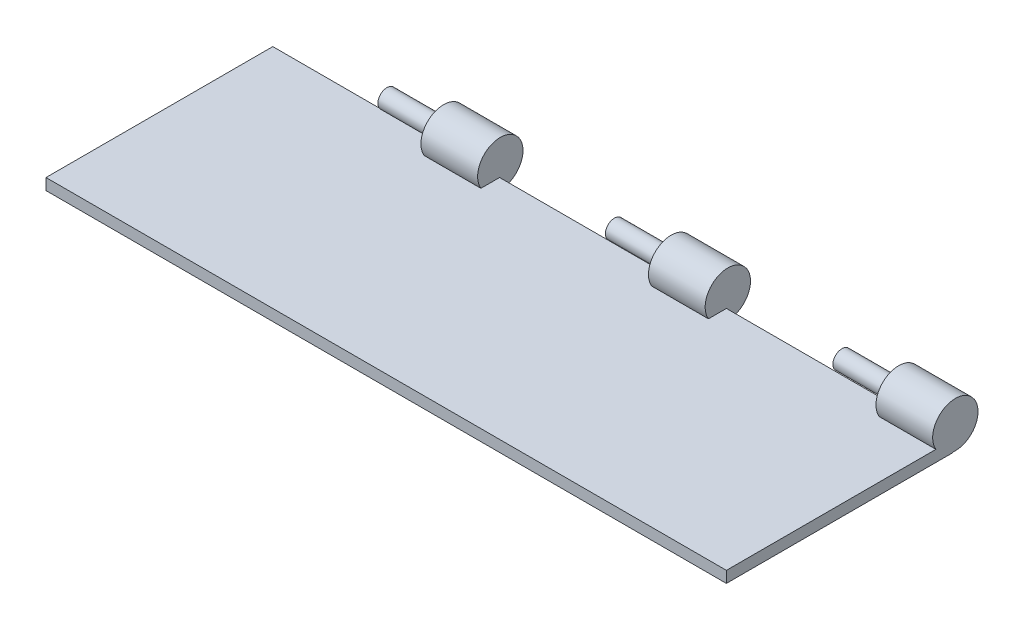
ISO-10303-21;
HEADER;
FILE_DESCRIPTION(('STEP AP214'),'2;1');
FILE_NAME('part.step','',(''),(''),'','','');
FILE_SCHEMA(('AUTOMOTIVE_DESIGN { 1 0 10303 214 1 1 1 1 }'));
ENDSEC;
DATA;
#1=APPLICATION_CONTEXT('core data for automotive mechanical design processes');
#2=APPLICATION_PROTOCOL_DEFINITION('international standard','automotive_design',2000,#1);
#3=PRODUCT_CONTEXT('',#1,'mechanical');
#4=PRODUCT('Part','Part','',(#3));
#5=PRODUCT_RELATED_PRODUCT_CATEGORY('part','',(#4));
#6=PRODUCT_DEFINITION_FORMATION('','',#4);
#7=PRODUCT_DEFINITION_CONTEXT('part definition',#1,'design');
#8=PRODUCT_DEFINITION('design','',#6,#7);
#9=PRODUCT_DEFINITION_SHAPE('','',#8);
#10=(LENGTH_UNIT() NAMED_UNIT(*) SI_UNIT(.MILLI.,.METRE.));
#11=(NAMED_UNIT(*) PLANE_ANGLE_UNIT() SI_UNIT($,.RADIAN.));
#12=(NAMED_UNIT(*) SI_UNIT($,.STERADIAN.) SOLID_ANGLE_UNIT());
#13=UNCERTAINTY_MEASURE_WITH_UNIT(LENGTH_MEASURE(1.E-05),#10,'distance_accuracy_value','');
#14=(GEOMETRIC_REPRESENTATION_CONTEXT(3) GLOBAL_UNCERTAINTY_ASSIGNED_CONTEXT((#13)) GLOBAL_UNIT_ASSIGNED_CONTEXT((#10,
#11,#12)) REPRESENTATION_CONTEXT('',''));
#15=CARTESIAN_POINT('',(0.,0.,0.));
#16=DIRECTION('',(0.,0.,1.));
#17=DIRECTION('',(1.,0.,0.));
#18=AXIS2_PLACEMENT_3D('',#15,#16,#17);
#19=CARTESIAN_POINT('',(150.,5.,-50.));
#20=DIRECTION('',(0.,0.,1.));
#21=DIRECTION('',(1.,0.,0.));
#22=AXIS2_PLACEMENT_3D('',#19,#20,#21);
#23=PLANE('',#22);
#24=DIRECTION('',(0.,1.,0.));
#25=VECTOR('',#24,1.);
#26=CARTESIAN_POINT('',(-74.9989884396446,5.,-50.));
#27=LINE('',#26,#25);
#28=CARTESIAN_POINT('',(-74.9989884396446,0.177370571045728,-50.));
#29=VERTEX_POINT('',#28);
#30=CARTESIAN_POINT('',(-74.9989884396446,5.,-50.));
#31=VERTEX_POINT('',#30);
#32=EDGE_CURVE('E131',#29,#31,#27,.T.);
#33=ORIENTED_EDGE('',*,*,#32,.F.);
#34=DIRECTION('',(1.,0.,0.));
#35=VECTOR('',#34,1.);
#36=CARTESIAN_POINT('',(-74.9989884396446,0.177370571045728,-50.));
#37=LINE('',#36,#35);
#38=CARTESIAN_POINT('',(-49.9989884396446,0.177370571045728,-50.));
#39=VERTEX_POINT('',#38);
#40=EDGE_CURVE('E137',#29,#39,#37,.T.);
#41=ORIENTED_EDGE('',*,*,#40,.T.);
#42=DIRECTION('',(0.,1.,0.));
#43=VECTOR('',#42,1.);
#44=CARTESIAN_POINT('',(-49.9989884396446,5.,-50.));
#45=LINE('',#44,#43);
#46=CARTESIAN_POINT('',(-49.9989884396446,5.,-50.));
#47=VERTEX_POINT('',#46);
#48=EDGE_CURVE('E123',#39,#47,#45,.T.);
#49=ORIENTED_EDGE('',*,*,#48,.T.);
#50=DIRECTION('',(-1.,0.,0.));
#51=VECTOR('',#50,1.);
#52=CARTESIAN_POINT('',(150.,5.,-50.));
#53=LINE('',#52,#51);
#54=CARTESIAN_POINT('',(25.0005057801777,5.,-50.));
#55=VERTEX_POINT('',#54);
#56=EDGE_CURVE('E188',#55,#47,#53,.T.);
#57=ORIENTED_EDGE('',*,*,#56,.F.);
#58=DIRECTION('',(0.,1.,0.));
#59=VECTOR('',#58,1.);
#60=CARTESIAN_POINT('',(25.0005057801777,5.,-50.));
#61=LINE('',#60,#59);
#62=CARTESIAN_POINT('',(25.0005057801777,0.192563318821932,-50.));
#63=VERTEX_POINT('',#62);
#64=EDGE_CURVE('E154',#63,#55,#61,.T.);
#65=ORIENTED_EDGE('',*,*,#64,.F.);
#66=DIRECTION('',(1.,0.,0.));
#67=VECTOR('',#66,1.);
#68=CARTESIAN_POINT('',(25.0005057801777,0.192563318821932,-50.));
#69=LINE('',#68,#67);
#70=CARTESIAN_POINT('',(50.0005057801777,0.192563318821932,-50.));
#71=VERTEX_POINT('',#70);
#72=EDGE_CURVE('E156',#63,#71,#69,.T.);
#73=ORIENTED_EDGE('',*,*,#72,.T.);
#74=DIRECTION('',(0.,1.,0.));
#75=VECTOR('',#74,1.);
#76=CARTESIAN_POINT('',(50.0005057801777,5.,-50.));
#77=LINE('',#76,#75);
#78=CARTESIAN_POINT('',(50.0005057801777,5.,-50.));
#79=VERTEX_POINT('',#78);
#80=EDGE_CURVE('E150',#71,#79,#77,.T.);
#81=ORIENTED_EDGE('',*,*,#80,.T.);
#82=CARTESIAN_POINT('',(125.,5.,-50.));
#83=VERTEX_POINT('',#82);
#84=EDGE_CURVE('E184',#83,#79,#53,.T.);
#85=ORIENTED_EDGE('',*,*,#84,.F.);
#86=DIRECTION('',(0.,1.,0.));
#87=VECTOR('',#86,1.);
#88=CARTESIAN_POINT('',(125.,5.,-50.));
#89=LINE('',#88,#87);
#90=CARTESIAN_POINT('',(125.,0.217935990525383,-50.));
#91=VERTEX_POINT('',#90);
#92=EDGE_CURVE('E166',#91,#83,#89,.T.);
#93=ORIENTED_EDGE('',*,*,#92,.F.);
#94=DIRECTION('',(1.,0.,0.));
#95=VECTOR('',#94,1.);
#96=CARTESIAN_POINT('',(125.,0.217935990525383,-50.));
#97=LINE('',#96,#95);
#98=CARTESIAN_POINT('',(150.,0.217935990525383,-50.));
#99=VERTEX_POINT('',#98);
#100=EDGE_CURVE('E172',#91,#99,#97,.T.);
#101=ORIENTED_EDGE('',*,*,#100,.T.);
#102=DIRECTION('',(0.,-1.,0.));
#103=VECTOR('',#102,1.);
#104=CARTESIAN_POINT('',(150.,5.,-50.));
#105=LINE('',#104,#103);
#106=CARTESIAN_POINT('',(150.,0.,-50.));
#107=VERTEX_POINT('',#106);
#108=EDGE_CURVE('E199',#99,#107,#105,.T.);
#109=ORIENTED_EDGE('',*,*,#108,.T.);
#110=DIRECTION('',(-1.,0.,0.));
#111=VECTOR('',#110,1.);
#112=CARTESIAN_POINT('',(150.,0.,-50.));
#113=LINE('',#112,#111);
#114=CARTESIAN_POINT('',(-150.,0.,-50.));
#115=VERTEX_POINT('',#114);
#116=EDGE_CURVE('E179',#107,#115,#113,.T.);
#117=ORIENTED_EDGE('',*,*,#116,.T.);
#118=DIRECTION('',(0.,-1.,0.));
#119=VECTOR('',#118,1.);
#120=CARTESIAN_POINT('',(-150.,5.,-50.));
#121=LINE('',#120,#119);
#122=CARTESIAN_POINT('',(-150.,5.,-50.));
#123=VERTEX_POINT('',#122);
#124=EDGE_CURVE('E187',#123,#115,#121,.T.);
#125=ORIENTED_EDGE('',*,*,#124,.F.);
#126=EDGE_CURVE('E183',#31,#123,#53,.T.);
#127=ORIENTED_EDGE('',*,*,#126,.F.);
#128=EDGE_LOOP('',(#33,#41,#49,#57,#65,#73,#81,#85,#93,#101,#109,#117,#125,#127));
#129=FACE_BOUND('',#128,.T.);
#130=ADVANCED_FACE('F37',(#129),#23,.F.);
#131=CARTESIAN_POINT('',(0.,5.,0.));
#132=DIRECTION('',(0.,-1.,0.));
#133=DIRECTION('',(0.,0.,-1.));
#134=AXIS2_PLACEMENT_3D('',#131,#132,#133);
#135=PLANE('',#134);
#136=DIRECTION('',(0.,0.,1.));
#137=VECTOR('',#136,1.);
#138=CARTESIAN_POINT('',(-74.9989884396446,5.,0.));
#139=LINE('',#138,#137);
#140=CARTESIAN_POINT('',(-74.9989884396446,5.,-41.7595972590535));
#141=VERTEX_POINT('',#140);
#142=EDGE_CURVE('E11',#31,#141,#139,.T.);
#143=ORIENTED_EDGE('',*,*,#142,.F.);
#144=ORIENTED_EDGE('',*,*,#126,.T.);
#145=DIRECTION('',(0.,0.,1.));
#146=VECTOR('',#145,1.);
#147=CARTESIAN_POINT('',(-150.,5.,-50.));
#148=LINE('',#147,#146);
#149=CARTESIAN_POINT('',(-150.,5.,50.));
#150=VERTEX_POINT('',#149);
#151=EDGE_CURVE('E175',#123,#150,#148,.T.);
#152=ORIENTED_EDGE('',*,*,#151,.T.);
#153=DIRECTION('',(1.,0.,0.));
#154=VECTOR('',#153,1.);
#155=CARTESIAN_POINT('',(150.,5.,50.));
#156=LINE('',#155,#154);
#157=CARTESIAN_POINT('',(150.,5.,50.));
#158=VERTEX_POINT('',#157);
#159=EDGE_CURVE('E178',#150,#158,#156,.T.);
#160=ORIENTED_EDGE('',*,*,#159,.T.);
#161=DIRECTION('',(0.,0.,-1.));
#162=VECTOR('',#161,1.);
#163=CARTESIAN_POINT('',(150.,5.,-50.));
#164=LINE('',#163,#162);
#165=CARTESIAN_POINT('',(150.,5.,-42.3956971874638));
#166=VERTEX_POINT('',#165);
#167=EDGE_CURVE('E181',#158,#166,#164,.T.);
#168=ORIENTED_EDGE('',*,*,#167,.T.);
#169=DIRECTION('',(1.,0.,0.));
#170=VECTOR('',#169,1.);
#171=CARTESIAN_POINT('',(125.,5.,-42.3956971874638));
#172=LINE('',#171,#170);
#173=CARTESIAN_POINT('',(125.,5.,-42.3956971874638));
#174=VERTEX_POINT('',#173);
#175=EDGE_CURVE('E210',#166,#174,#172,.F.);
#176=ORIENTED_EDGE('',*,*,#175,.T.);
#177=DIRECTION('',(0.,0.,1.));
#178=VECTOR('',#177,1.);
#179=CARTESIAN_POINT('',(125.,5.,0.));
#180=LINE('',#179,#178);
#181=EDGE_CURVE('E207',#83,#174,#180,.T.);
#182=ORIENTED_EDGE('',*,*,#181,.F.);
#183=ORIENTED_EDGE('',*,*,#84,.T.);
#184=DIRECTION('',(0.,0.,1.));
#185=VECTOR('',#184,1.);
#186=CARTESIAN_POINT('',(50.0005057801777,5.,0.));
#187=LINE('',#186,#185);
#188=CARTESIAN_POINT('',(50.0005057801777,5.,-42.0776472232586));
#189=VERTEX_POINT('',#188);
#190=EDGE_CURVE('E212',#79,#189,#187,.T.);
#191=ORIENTED_EDGE('',*,*,#190,.T.);
#192=DIRECTION('',(1.,0.,0.));
#193=VECTOR('',#192,1.);
#194=CARTESIAN_POINT('',(25.0005057801777,5.,-42.0776472232586));
#195=LINE('',#194,#193);
#196=CARTESIAN_POINT('',(25.0005057801777,5.,-42.0776472232586));
#197=VERTEX_POINT('',#196);
#198=EDGE_CURVE('E217',#189,#197,#195,.F.);
#199=ORIENTED_EDGE('',*,*,#198,.T.);
#200=DIRECTION('',(0.,0.,1.));
#201=VECTOR('',#200,1.);
#202=CARTESIAN_POINT('',(25.0005057801777,5.,0.));
#203=LINE('',#202,#201);
#204=EDGE_CURVE('E220',#55,#197,#203,.T.);
#205=ORIENTED_EDGE('',*,*,#204,.F.);
#206=ORIENTED_EDGE('',*,*,#56,.T.);
#207=DIRECTION('',(0.,0.,1.));
#208=VECTOR('',#207,1.);
#209=CARTESIAN_POINT('',(-49.9989884396446,5.,0.));
#210=LINE('',#209,#208);
#211=CARTESIAN_POINT('',(-49.9989884396446,5.,-41.7595972590535));
#212=VERTEX_POINT('',#211);
#213=EDGE_CURVE('E126',#47,#212,#210,.T.);
#214=ORIENTED_EDGE('',*,*,#213,.T.);
#215=DIRECTION('',(1.,0.,0.));
#216=VECTOR('',#215,1.);
#217=CARTESIAN_POINT('',(-74.9989884396446,5.,-41.7595972590535));
#218=LINE('',#217,#216);
#219=EDGE_CURVE('E45',#212,#141,#218,.F.);
#220=ORIENTED_EDGE('',*,*,#219,.T.);
#221=EDGE_LOOP('',(#143,#144,#152,#160,#168,#176,#182,#183,#191,#199,#205,#206,#214,#220));
#222=FACE_BOUND('',#221,.T.);
#223=ADVANCED_FACE('F224',(#222),#135,.F.);
#224=CARTESIAN_POINT('',(-150.,5.,-50.));
#225=DIRECTION('',(1.,0.,0.));
#226=DIRECTION('',(0.,0.,-1.));
#227=AXIS2_PLACEMENT_3D('',#224,#225,#226);
#228=PLANE('',#227);
#229=DIRECTION('',(0.,0.,1.));
#230=VECTOR('',#229,1.);
#231=CARTESIAN_POINT('',(-150.,0.,-50.));
#232=LINE('',#231,#230);
#233=CARTESIAN_POINT('',(-150.,0.,50.));
#234=VERTEX_POINT('',#233);
#235=EDGE_CURVE('E174',#115,#234,#232,.T.);
#236=ORIENTED_EDGE('',*,*,#235,.T.);
#237=DIRECTION('',(0.,-1.,0.));
#238=VECTOR('',#237,1.);
#239=CARTESIAN_POINT('',(-150.,5.,50.));
#240=LINE('',#239,#238);
#241=EDGE_CURVE('E204',#150,#234,#240,.T.);
#242=ORIENTED_EDGE('',*,*,#241,.F.);
#243=ORIENTED_EDGE('',*,*,#151,.F.);
#244=ORIENTED_EDGE('',*,*,#124,.T.);
#245=EDGE_LOOP('',(#236,#242,#243,#244));
#246=FACE_BOUND('',#245,.T.);
#247=ADVANCED_FACE('F39',(#246),#228,.F.);
#248=CARTESIAN_POINT('',(150.,5.,50.));
#249=DIRECTION('',(0.,0.,-1.));
#250=DIRECTION('',(-1.,0.,0.));
#251=AXIS2_PLACEMENT_3D('',#248,#249,#250);
#252=PLANE('',#251);
#253=DIRECTION('',(1.,0.,0.));
#254=VECTOR('',#253,1.);
#255=CARTESIAN_POINT('',(150.,0.,50.));
#256=LINE('',#255,#254);
#257=CARTESIAN_POINT('',(150.,0.,50.));
#258=VERTEX_POINT('',#257);
#259=EDGE_CURVE('E191',#234,#258,#256,.T.);
#260=ORIENTED_EDGE('',*,*,#259,.T.);
#261=DIRECTION('',(0.,-1.,0.));
#262=VECTOR('',#261,1.);
#263=CARTESIAN_POINT('',(150.,5.,50.));
#264=LINE('',#263,#262);
#265=EDGE_CURVE('E201',#158,#258,#264,.T.);
#266=ORIENTED_EDGE('',*,*,#265,.F.);
#267=ORIENTED_EDGE('',*,*,#159,.F.);
#268=ORIENTED_EDGE('',*,*,#241,.T.);
#269=EDGE_LOOP('',(#260,#266,#267,#268));
#270=FACE_BOUND('',#269,.T.);
#271=ADVANCED_FACE('F234',(#270),#252,.F.);
#272=CARTESIAN_POINT('',(150.,5.,-50.));
#273=DIRECTION('',(-1.,0.,0.));
#274=DIRECTION('',(0.,0.,1.));
#275=AXIS2_PLACEMENT_3D('',#272,#273,#274);
#276=PLANE('',#275);
#277=ORIENTED_EDGE('',*,*,#108,.F.);
#278=CARTESIAN_POINT('',(150.,10.172311348783,-50.9541547185409));
#279=DIRECTION('',(1.,0.,0.));
#280=DIRECTION('',(0.,0.,-1.));
#281=AXIS2_PLACEMENT_3D('',#278,#279,#280);
#282=CIRCLE('',#281,10.);
#283=EDGE_CURVE('E167',#99,#166,#282,.T.);
#284=ORIENTED_EDGE('',*,*,#283,.T.);
#285=ORIENTED_EDGE('',*,*,#167,.F.);
#286=ORIENTED_EDGE('',*,*,#265,.T.);
#287=DIRECTION('',(0.,0.,-1.));
#288=VECTOR('',#287,1.);
#289=CARTESIAN_POINT('',(150.,0.,-50.));
#290=LINE('',#289,#288);
#291=EDGE_CURVE('E193',#258,#107,#290,.T.);
#292=ORIENTED_EDGE('',*,*,#291,.T.);
#293=EDGE_LOOP('',(#277,#284,#285,#286,#292));
#294=FACE_BOUND('',#293,.T.);
#295=ADVANCED_FACE('F245',(#294),#276,.F.);
#296=CARTESIAN_POINT('',(0.,0.,0.));
#297=DIRECTION('',(0.,-1.,0.));
#298=DIRECTION('',(0.,0.,-1.));
#299=AXIS2_PLACEMENT_3D('',#296,#297,#298);
#300=PLANE('',#299);
#301=ORIENTED_EDGE('',*,*,#235,.F.);
#302=ORIENTED_EDGE('',*,*,#116,.F.);
#303=ORIENTED_EDGE('',*,*,#291,.F.);
#304=ORIENTED_EDGE('',*,*,#259,.F.);
#305=EDGE_LOOP('',(#301,#302,#303,#304));
#306=FACE_BOUND('',#305,.T.);
#307=ADVANCED_FACE('F276',(#306),#300,.T.);
#308=CARTESIAN_POINT('',(125.,10.172311348783,-50.9541547185409));
#309=DIRECTION('',(1.,0.,0.));
#310=DIRECTION('',(0.,0.,-1.));
#311=AXIS2_PLACEMENT_3D('',#308,#309,#310);
#312=CYLINDRICAL_SURFACE('',#311,10.);
#313=ORIENTED_EDGE('',*,*,#100,.F.);
#314=CARTESIAN_POINT('',(125.,10.172311348783,-50.9541547185409));
#315=DIRECTION('',(1.,0.,0.));
#316=DIRECTION('',(0.,0.,-1.));
#317=AXIS2_PLACEMENT_3D('',#314,#315,#316);
#318=CIRCLE('',#317,10.);
#319=EDGE_CURVE('E163',#91,#174,#318,.T.);
#320=ORIENTED_EDGE('',*,*,#319,.T.);
#321=ORIENTED_EDGE('',*,*,#175,.F.);
#322=ORIENTED_EDGE('',*,*,#283,.F.);
#323=EDGE_LOOP('',(#313,#320,#321,#322));
#324=FACE_BOUND('',#323,.T.);
#325=ADVANCED_FACE('F242',(#324),#312,.T.);
#326=CARTESIAN_POINT('',(125.,10.172311348783,-50.9541547185409));
#327=DIRECTION('',(1.,0.,0.));
#328=DIRECTION('',(0.,0.,-1.));
#329=AXIS2_PLACEMENT_3D('',#326,#327,#328);
#330=PLANE('',#329);
#331=CARTESIAN_POINT('',(125.,10.172311348783,-50.9541547185409));
#332=DIRECTION('',(1.,0.,0.));
#333=DIRECTION('',(0.,0.,-1.));
#334=AXIS2_PLACEMENT_3D('',#331,#332,#333);
#335=CIRCLE('',#334,4.00000000000001);
#336=CARTESIAN_POINT('',(125.,10.172311348783,-54.9541547185409));
#337=VERTEX_POINT('',#336);
#338=EDGE_CURVE('E162',#337,#337,#335,.T.);
#339=ORIENTED_EDGE('',*,*,#338,.T.);
#340=EDGE_LOOP('',(#339));
#341=FACE_BOUND('',#340,.T.);
#342=ORIENTED_EDGE('',*,*,#319,.F.);
#343=ORIENTED_EDGE('',*,*,#92,.T.);
#344=ORIENTED_EDGE('',*,*,#181,.T.);
#345=EDGE_LOOP('',(#342,#343,#344));
#346=FACE_BOUND('',#345,.T.);
#347=ADVANCED_FACE('F249',(#341,#346),#330,.F.);
#348=CARTESIAN_POINT('',(100.,10.172311348783,-50.9541547185409));
#349=DIRECTION('',(1.,0.,0.));
#350=DIRECTION('',(0.,0.,-1.));
#351=AXIS2_PLACEMENT_3D('',#348,#349,#350);
#352=CYLINDRICAL_SURFACE('',#351,4.00000000000001);
#353=CARTESIAN_POINT('',(100.,10.172311348783,-50.9541547185409));
#354=DIRECTION('',(1.,0.,0.));
#355=DIRECTION('',(0.,0.,-1.));
#356=AXIS2_PLACEMENT_3D('',#353,#354,#355);
#357=CIRCLE('',#356,4.00000000000001);
#358=CARTESIAN_POINT('',(100.,10.172311348783,-54.9541547185409));
#359=VERTEX_POINT('',#358);
#360=EDGE_CURVE('E159',#359,#359,#357,.T.);
#361=ORIENTED_EDGE('',*,*,#360,.T.);
#362=EDGE_LOOP('',(#361));
#363=FACE_BOUND('',#362,.T.);
#364=ORIENTED_EDGE('',*,*,#338,.F.);
#365=EDGE_LOOP('',(#364));
#366=FACE_BOUND('',#365,.T.);
#367=ADVANCED_FACE('F407',(#363,#366),#352,.T.);
#368=CARTESIAN_POINT('',(100.,10.172311348783,-50.9541547185409));
#369=DIRECTION('',(1.,0.,0.));
#370=DIRECTION('',(0.,0.,-1.));
#371=AXIS2_PLACEMENT_3D('',#368,#369,#370);
#372=PLANE('',#371);
#373=ORIENTED_EDGE('',*,*,#360,.F.);
#374=EDGE_LOOP('',(#373));
#375=FACE_BOUND('',#374,.T.);
#376=ADVANCED_FACE('F264',(#375),#372,.F.);
#377=CARTESIAN_POINT('',(25.0005057801777,10.172311348783,-50.6361047543358));
#378=DIRECTION('',(1.,0.,0.));
#379=DIRECTION('',(0.,0.,-1.));
#380=AXIS2_PLACEMENT_3D('',#377,#378,#379);
#381=CYLINDRICAL_SURFACE('',#380,10.);
#382=ORIENTED_EDGE('',*,*,#72,.F.);
#383=CARTESIAN_POINT('',(25.0005057801777,10.172311348783,-50.6361047543358));
#384=DIRECTION('',(1.,0.,0.));
#385=DIRECTION('',(0.,0.,-1.));
#386=AXIS2_PLACEMENT_3D('',#383,#384,#385);
#387=CIRCLE('',#386,10.);
#388=EDGE_CURVE('E145',#63,#197,#387,.T.);
#389=ORIENTED_EDGE('',*,*,#388,.T.);
#390=ORIENTED_EDGE('',*,*,#198,.F.);
#391=CARTESIAN_POINT('',(50.0005057801777,10.172311348783,-50.6361047543358));
#392=DIRECTION('',(1.,0.,0.));
#393=DIRECTION('',(0.,0.,-1.));
#394=AXIS2_PLACEMENT_3D('',#391,#392,#393);
#395=CIRCLE('',#394,10.);
#396=EDGE_CURVE('E60',#71,#189,#395,.T.);
#397=ORIENTED_EDGE('',*,*,#396,.F.);
#398=EDGE_LOOP('',(#382,#389,#390,#397));
#399=FACE_BOUND('',#398,.T.);
#400=ADVANCED_FACE('F252',(#399),#381,.T.);
#401=CARTESIAN_POINT('',(25.0005057801777,10.172311348783,-50.6361047543358));
#402=DIRECTION('',(1.,0.,0.));
#403=DIRECTION('',(0.,0.,-1.));
#404=AXIS2_PLACEMENT_3D('',#401,#402,#403);
#405=PLANE('',#404);
#406=CARTESIAN_POINT('',(25.0005057801777,10.172311348783,-50.6361047543358));
#407=DIRECTION('',(1.,0.,0.));
#408=DIRECTION('',(0.,0.,-1.));
#409=AXIS2_PLACEMENT_3D('',#406,#407,#408);
#410=CIRCLE('',#409,4.00000000000001);
#411=CARTESIAN_POINT('',(25.0005057801777,10.172311348783,-54.6361047543358));
#412=VERTEX_POINT('',#411);
#413=EDGE_CURVE('E140',#412,#412,#410,.T.);
#414=ORIENTED_EDGE('',*,*,#413,.T.);
#415=EDGE_LOOP('',(#414));
#416=FACE_BOUND('',#415,.T.);
#417=ORIENTED_EDGE('',*,*,#388,.F.);
#418=ORIENTED_EDGE('',*,*,#64,.T.);
#419=ORIENTED_EDGE('',*,*,#204,.T.);
#420=EDGE_LOOP('',(#417,#418,#419));
#421=FACE_BOUND('',#420,.T.);
#422=ADVANCED_FACE('F255',(#416,#421),#405,.F.);
#423=CARTESIAN_POINT('',(50.0005057801777,10.172311348783,-50.6361047543358));
#424=DIRECTION('',(1.,0.,0.));
#425=DIRECTION('',(0.,0.,-1.));
#426=AXIS2_PLACEMENT_3D('',#423,#424,#425);
#427=PLANE('',#426);
#428=ORIENTED_EDGE('',*,*,#80,.F.);
#429=ORIENTED_EDGE('',*,*,#396,.T.);
#430=ORIENTED_EDGE('',*,*,#190,.F.);
#431=EDGE_LOOP('',(#428,#429,#430));
#432=FACE_BOUND('',#431,.T.);
#433=ADVANCED_FACE('F250',(#432),#427,.T.);
#434=CARTESIAN_POINT('',(-74.9989884396446,10.172311348783,-50.3180547901306));
#435=DIRECTION('',(1.,0.,0.));
#436=DIRECTION('',(0.,0.,-1.));
#437=AXIS2_PLACEMENT_3D('',#434,#435,#436);
#438=CYLINDRICAL_SURFACE('',#437,10.);
#439=ORIENTED_EDGE('',*,*,#40,.F.);
#440=CARTESIAN_POINT('',(-74.9989884396446,10.172311348783,-50.3180547901306));
#441=DIRECTION('',(1.,0.,0.));
#442=DIRECTION('',(0.,0.,-1.));
#443=AXIS2_PLACEMENT_3D('',#440,#441,#442);
#444=CIRCLE('',#443,10.);
#445=EDGE_CURVE('E132',#29,#141,#444,.T.);
#446=ORIENTED_EDGE('',*,*,#445,.T.);
#447=ORIENTED_EDGE('',*,*,#219,.F.);
#448=CARTESIAN_POINT('',(-49.9989884396446,10.172311348783,-50.3180547901306));
#449=DIRECTION('',(1.,0.,0.));
#450=DIRECTION('',(0.,0.,-1.));
#451=AXIS2_PLACEMENT_3D('',#448,#449,#450);
#452=CIRCLE('',#451,10.);
#453=EDGE_CURVE('E52',#39,#212,#452,.T.);
#454=ORIENTED_EDGE('',*,*,#453,.F.);
#455=EDGE_LOOP('',(#439,#446,#447,#454));
#456=FACE_BOUND('',#455,.T.);
#457=ADVANCED_FACE('F135',(#456),#438,.T.);
#458=CARTESIAN_POINT('',(-74.9989884396446,10.172311348783,-50.3180547901306));
#459=DIRECTION('',(1.,0.,0.));
#460=DIRECTION('',(0.,0.,-1.));
#461=AXIS2_PLACEMENT_3D('',#458,#459,#460);
#462=PLANE('',#461);
#463=CARTESIAN_POINT('',(-74.9989884396446,10.172311348783,-50.3180547901306));
#464=DIRECTION('',(1.,0.,0.));
#465=DIRECTION('',(0.,0.,-1.));
#466=AXIS2_PLACEMENT_3D('',#463,#464,#465);
#467=CIRCLE('',#466,4.00000000000001);
#468=CARTESIAN_POINT('',(-74.9989884396446,10.172311348783,-54.3180547901306));
#469=VERTEX_POINT('',#468);
#470=EDGE_CURVE('E482',#469,#469,#467,.T.);
#471=ORIENTED_EDGE('',*,*,#470,.T.);
#472=EDGE_LOOP('',(#471));
#473=FACE_BOUND('',#472,.T.);
#474=ORIENTED_EDGE('',*,*,#445,.F.);
#475=ORIENTED_EDGE('',*,*,#32,.T.);
#476=ORIENTED_EDGE('',*,*,#142,.T.);
#477=EDGE_LOOP('',(#474,#475,#476));
#478=FACE_BOUND('',#477,.T.);
#479=ADVANCED_FACE('F322',(#473,#478),#462,.F.);
#480=CARTESIAN_POINT('',(-49.9989884396446,10.172311348783,-50.3180547901306));
#481=DIRECTION('',(1.,0.,0.));
#482=DIRECTION('',(0.,0.,-1.));
#483=AXIS2_PLACEMENT_3D('',#480,#481,#482);
#484=PLANE('',#483);
#485=ORIENTED_EDGE('',*,*,#48,.F.);
#486=ORIENTED_EDGE('',*,*,#453,.T.);
#487=ORIENTED_EDGE('',*,*,#213,.F.);
#488=EDGE_LOOP('',(#485,#486,#487));
#489=FACE_BOUND('',#488,.T.);
#490=ADVANCED_FACE('F124',(#489),#484,.T.);
#491=CARTESIAN_POINT('',(0.000505780177725845,10.172311348783,-50.6361047543358));
#492=DIRECTION('',(1.,0.,0.));
#493=DIRECTION('',(0.,0.,-1.));
#494=AXIS2_PLACEMENT_3D('',#491,#492,#493);
#495=CYLINDRICAL_SURFACE('',#494,4.00000000000001);
#496=CARTESIAN_POINT('',(0.000505780177725845,10.172311348783,-50.6361047543358));
#497=DIRECTION('',(1.,0.,0.));
#498=DIRECTION('',(0.,0.,-1.));
#499=AXIS2_PLACEMENT_3D('',#496,#497,#498);
#500=CIRCLE('',#499,4.00000000000001);
#501=CARTESIAN_POINT('',(0.000505780177725845,10.172311348783,-54.6361047543358));
#502=VERTEX_POINT('',#501);
#503=EDGE_CURVE('E485',#502,#502,#500,.T.);
#504=ORIENTED_EDGE('',*,*,#503,.T.);
#505=EDGE_LOOP('',(#504));
#506=FACE_BOUND('',#505,.T.);
#507=ORIENTED_EDGE('',*,*,#413,.F.);
#508=EDGE_LOOP('',(#507));
#509=FACE_BOUND('',#508,.T.);
#510=ADVANCED_FACE('F341',(#506,#509),#495,.T.);
#511=CARTESIAN_POINT('',(0.000505780177725845,10.172311348783,-50.6361047543358));
#512=DIRECTION('',(1.,0.,0.));
#513=DIRECTION('',(0.,0.,-1.));
#514=AXIS2_PLACEMENT_3D('',#511,#512,#513);
#515=PLANE('',#514);
#516=ORIENTED_EDGE('',*,*,#503,.F.);
#517=EDGE_LOOP('',(#516));
#518=FACE_BOUND('',#517,.T.);
#519=ADVANCED_FACE('F351',(#518),#515,.F.);
#520=CARTESIAN_POINT('',(-99.9989884396446,10.172311348783,-50.3180547901306));
#521=DIRECTION('',(1.,0.,0.));
#522=DIRECTION('',(0.,0.,-1.));
#523=AXIS2_PLACEMENT_3D('',#520,#521,#522);
#524=CYLINDRICAL_SURFACE('',#523,4.00000000000001);
#525=CARTESIAN_POINT('',(-99.9989884396446,10.172311348783,-50.3180547901306));
#526=DIRECTION('',(1.,0.,0.));
#527=DIRECTION('',(0.,0.,-1.));
#528=AXIS2_PLACEMENT_3D('',#525,#526,#527);
#529=CIRCLE('',#528,4.00000000000001);
#530=CARTESIAN_POINT('',(-99.9989884396446,10.172311348783,-54.3180547901306));
#531=VERTEX_POINT('',#530);
#532=EDGE_CURVE('E481',#531,#531,#529,.T.);
#533=ORIENTED_EDGE('',*,*,#532,.T.);
#534=EDGE_LOOP('',(#533));
#535=FACE_BOUND('',#534,.T.);
#536=ORIENTED_EDGE('',*,*,#470,.F.);
#537=EDGE_LOOP('',(#536));
#538=FACE_BOUND('',#537,.T.);
#539=ADVANCED_FACE('F362',(#535,#538),#524,.T.);
#540=CARTESIAN_POINT('',(-99.9989884396446,10.172311348783,-50.3180547901306));
#541=DIRECTION('',(1.,0.,0.));
#542=DIRECTION('',(0.,0.,-1.));
#543=AXIS2_PLACEMENT_3D('',#540,#541,#542);
#544=PLANE('',#543);
#545=ORIENTED_EDGE('',*,*,#532,.F.);
#546=EDGE_LOOP('',(#545));
#547=FACE_BOUND('',#546,.T.);
#548=ADVANCED_FACE('F373',(#547),#544,.F.);
#549=CLOSED_SHELL('',(#130,#223,#247,#271,#295,#307,#325,#347,#367,#376,#400,#422,#433,#457,
#479,#490,#510,#519,#539,#548));
#550=MANIFOLD_SOLID_BREP('B2',#549);
#551=ADVANCED_BREP_SHAPE_REPRESENTATION('',(#18,#550),#14);
#552=SHAPE_DEFINITION_REPRESENTATION(#9,#551);
ENDSEC;
END-ISO-10303-21;
